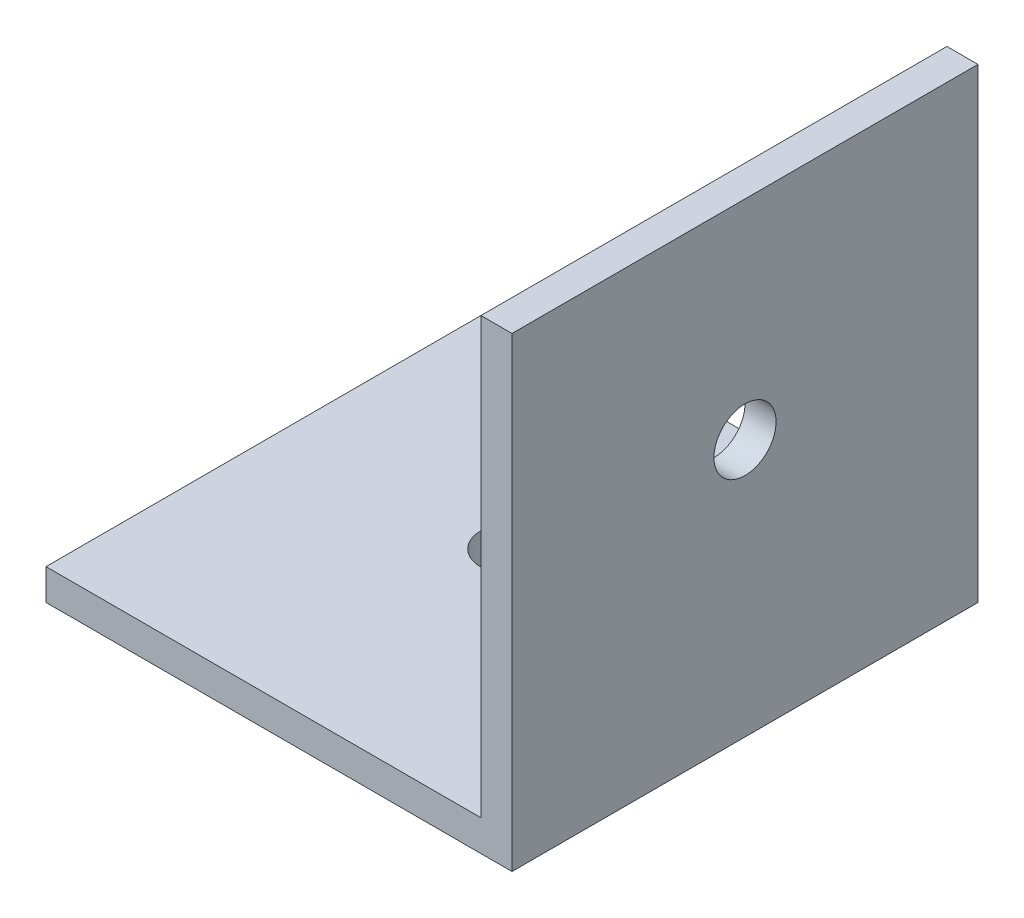
ISO-10303-21;
HEADER;
FILE_DESCRIPTION(('STEP AP214'),'2;1');
FILE_NAME('part.step','',(''),(''),'','','');
FILE_SCHEMA(('AUTOMOTIVE_DESIGN { 1 0 10303 214 1 1 1 1 }'));
ENDSEC;
DATA;
#1=APPLICATION_CONTEXT('core data for automotive mechanical design processes');
#2=APPLICATION_PROTOCOL_DEFINITION('international standard','automotive_design',2000,#1);
#3=PRODUCT_CONTEXT('',#1,'mechanical');
#4=PRODUCT('Part','Part','',(#3));
#5=PRODUCT_RELATED_PRODUCT_CATEGORY('part','',(#4));
#6=PRODUCT_DEFINITION_FORMATION('','',#4);
#7=PRODUCT_DEFINITION_CONTEXT('part definition',#1,'design');
#8=PRODUCT_DEFINITION('design','',#6,#7);
#9=PRODUCT_DEFINITION_SHAPE('','',#8);
#10=(LENGTH_UNIT() NAMED_UNIT(*) SI_UNIT(.MILLI.,.METRE.));
#11=(NAMED_UNIT(*) PLANE_ANGLE_UNIT() SI_UNIT($,.RADIAN.));
#12=(NAMED_UNIT(*) SI_UNIT($,.STERADIAN.) SOLID_ANGLE_UNIT());
#13=UNCERTAINTY_MEASURE_WITH_UNIT(LENGTH_MEASURE(1.E-05),#10,'distance_accuracy_value','');
#14=(GEOMETRIC_REPRESENTATION_CONTEXT(3) GLOBAL_UNCERTAINTY_ASSIGNED_CONTEXT((#13)) GLOBAL_UNIT_ASSIGNED_CONTEXT((#10,
#11,#12)) REPRESENTATION_CONTEXT('',''));
#15=CARTESIAN_POINT('',(0.,0.,0.));
#16=DIRECTION('',(0.,0.,1.));
#17=DIRECTION('',(1.,0.,0.));
#18=AXIS2_PLACEMENT_3D('',#15,#16,#17);
#19=CARTESIAN_POINT('',(0.,15.,15.));
#20=DIRECTION('',(-1.,0.,0.));
#21=DIRECTION('',(0.,-1.,0.));
#22=AXIS2_PLACEMENT_3D('',#19,#20,#21);
#23=PLANE('',#22);
#24=CARTESIAN_POINT('',(0.,8.28833267638939,7.5));
#25=DIRECTION('',(-1.,0.,0.));
#26=DIRECTION('',(0.,-1.,0.));
#27=AXIS2_PLACEMENT_3D('',#24,#25,#26);
#28=CIRCLE('',#27,1.);
#29=CARTESIAN_POINT('',(0.,7.28833267638939,7.5));
#30=VERTEX_POINT('',#29);
#31=EDGE_CURVE('E127',#30,#30,#28,.T.);
#32=ORIENTED_EDGE('',*,*,#31,.T.);
#33=EDGE_LOOP('',(#32));
#34=FACE_BOUND('',#33,.T.);
#35=DIRECTION('',(0.,1.,0.));
#36=VECTOR('',#35,1.);
#37=CARTESIAN_POINT('',(0.,15.,0.));
#38=LINE('',#37,#36);
#39=CARTESIAN_POINT('',(0.,0.,0.));
#40=VERTEX_POINT('',#39);
#41=CARTESIAN_POINT('',(0.,15.,0.));
#42=VERTEX_POINT('',#41);
#43=EDGE_CURVE('E123',#40,#42,#38,.T.);
#44=ORIENTED_EDGE('',*,*,#43,.T.);
#45=DIRECTION('',(0.,0.,-1.));
#46=VECTOR('',#45,1.);
#47=CARTESIAN_POINT('',(0.,15.,15.));
#48=LINE('',#47,#46);
#49=CARTESIAN_POINT('',(0.,15.,15.));
#50=VERTEX_POINT('',#49);
#51=EDGE_CURVE('E11',#50,#42,#48,.T.);
#52=ORIENTED_EDGE('',*,*,#51,.F.);
#53=DIRECTION('',(0.,1.,0.));
#54=VECTOR('',#53,1.);
#55=CARTESIAN_POINT('',(0.,15.,15.));
#56=LINE('',#55,#54);
#57=CARTESIAN_POINT('',(0.,0.,15.));
#58=VERTEX_POINT('',#57);
#59=EDGE_CURVE('E134',#58,#50,#56,.T.);
#60=ORIENTED_EDGE('',*,*,#59,.F.);
#61=DIRECTION('',(0.,0.,-1.));
#62=VECTOR('',#61,1.);
#63=CARTESIAN_POINT('',(0.,0.,15.));
#64=LINE('',#63,#62);
#65=EDGE_CURVE('E119',#58,#40,#64,.T.);
#66=ORIENTED_EDGE('',*,*,#65,.T.);
#67=EDGE_LOOP('',(#44,#52,#60,#66));
#68=FACE_BOUND('',#67,.T.);
#69=ADVANCED_FACE('F39',(#34,#68),#23,.F.);
#70=CARTESIAN_POINT('',(-1.,15.,15.));
#71=DIRECTION('',(0.,-1.,0.));
#72=DIRECTION('',(0.,0.,-1.));
#73=AXIS2_PLACEMENT_3D('',#70,#71,#72);
#74=PLANE('',#73);
#75=DIRECTION('',(-1.,0.,0.));
#76=VECTOR('',#75,1.);
#77=CARTESIAN_POINT('',(-1.,15.,0.));
#78=LINE('',#77,#76);
#79=CARTESIAN_POINT('',(-1.,15.,0.));
#80=VERTEX_POINT('',#79);
#81=EDGE_CURVE('E126',#42,#80,#78,.T.);
#82=ORIENTED_EDGE('',*,*,#81,.T.);
#83=DIRECTION('',(0.,0.,-1.));
#84=VECTOR('',#83,1.);
#85=CARTESIAN_POINT('',(-1.,15.,15.));
#86=LINE('',#85,#84);
#87=CARTESIAN_POINT('',(-1.,15.,15.));
#88=VERTEX_POINT('',#87);
#89=EDGE_CURVE('E47',#88,#80,#86,.T.);
#90=ORIENTED_EDGE('',*,*,#89,.F.);
#91=DIRECTION('',(-1.,0.,0.));
#92=VECTOR('',#91,1.);
#93=CARTESIAN_POINT('',(-1.,15.,15.));
#94=LINE('',#93,#92);
#95=EDGE_CURVE('E92',#50,#88,#94,.T.);
#96=ORIENTED_EDGE('',*,*,#95,.F.);
#97=ORIENTED_EDGE('',*,*,#51,.T.);
#98=EDGE_LOOP('',(#82,#90,#96,#97));
#99=FACE_BOUND('',#98,.T.);
#100=ADVANCED_FACE('F160',(#99),#74,.F.);
#101=CARTESIAN_POINT('',(-1.,0.999999999999998,15.));
#102=DIRECTION('',(1.,0.,0.));
#103=DIRECTION('',(0.,1.,0.));
#104=AXIS2_PLACEMENT_3D('',#101,#102,#103);
#105=PLANE('',#104);
#106=CARTESIAN_POINT('',(-1.,8.28833267638939,7.5));
#107=DIRECTION('',(-1.,0.,0.));
#108=DIRECTION('',(0.,-1.,0.));
#109=AXIS2_PLACEMENT_3D('',#106,#107,#108);
#110=CIRCLE('',#109,1.);
#111=CARTESIAN_POINT('',(-1.,7.28833267638939,7.5));
#112=VERTEX_POINT('',#111);
#113=EDGE_CURVE('E168',#112,#112,#110,.T.);
#114=ORIENTED_EDGE('',*,*,#113,.F.);
#115=EDGE_LOOP('',(#114));
#116=FACE_BOUND('',#115,.T.);
#117=DIRECTION('',(0.,-1.,0.));
#118=VECTOR('',#117,1.);
#119=CARTESIAN_POINT('',(-1.,0.999999999999998,0.));
#120=LINE('',#119,#118);
#121=CARTESIAN_POINT('',(-1.,0.999999999999998,0.));
#122=VERTEX_POINT('',#121);
#123=EDGE_CURVE('E129',#80,#122,#120,.T.);
#124=ORIENTED_EDGE('',*,*,#123,.T.);
#125=DIRECTION('',(0.,0.,-1.));
#126=VECTOR('',#125,1.);
#127=CARTESIAN_POINT('',(-1.,0.999999999999998,15.));
#128=LINE('',#127,#126);
#129=CARTESIAN_POINT('',(-1.,0.999999999999998,15.));
#130=VERTEX_POINT('',#129);
#131=EDGE_CURVE('E114',#130,#122,#128,.T.);
#132=ORIENTED_EDGE('',*,*,#131,.F.);
#133=DIRECTION('',(0.,-1.,0.));
#134=VECTOR('',#133,1.);
#135=CARTESIAN_POINT('',(-1.,0.999999999999998,15.));
#136=LINE('',#135,#134);
#137=EDGE_CURVE('E105',#88,#130,#136,.T.);
#138=ORIENTED_EDGE('',*,*,#137,.F.);
#139=ORIENTED_EDGE('',*,*,#89,.T.);
#140=EDGE_LOOP('',(#124,#132,#138,#139));
#141=FACE_BOUND('',#140,.T.);
#142=ADVANCED_FACE('F140',(#116,#141),#105,.F.);
#143=CARTESIAN_POINT('',(-15.,0.999999999999998,15.));
#144=DIRECTION('',(0.,-1.,0.));
#145=DIRECTION('',(0.,0.,-1.));
#146=AXIS2_PLACEMENT_3D('',#143,#144,#145);
#147=PLANE('',#146);
#148=CARTESIAN_POINT('',(-8.,0.999999999999998,7.01198453366372));
#149=DIRECTION('',(0.,1.,0.));
#150=DIRECTION('',(0.,0.,1.));
#151=AXIS2_PLACEMENT_3D('',#148,#149,#150);
#152=CIRCLE('',#151,1.);
#153=CARTESIAN_POINT('',(-8.,0.999999999999998,8.01198453366372));
#154=VERTEX_POINT('',#153);
#155=EDGE_CURVE('E174',#154,#154,#152,.T.);
#156=ORIENTED_EDGE('',*,*,#155,.F.);
#157=EDGE_LOOP('',(#156));
#158=FACE_BOUND('',#157,.T.);
#159=DIRECTION('',(-1.,0.,0.));
#160=VECTOR('',#159,1.);
#161=CARTESIAN_POINT('',(-15.,0.999999999999998,0.));
#162=LINE('',#161,#160);
#163=CARTESIAN_POINT('',(-15.,0.999999999999998,0.));
#164=VERTEX_POINT('',#163);
#165=EDGE_CURVE('E113',#122,#164,#162,.T.);
#166=ORIENTED_EDGE('',*,*,#165,.T.);
#167=DIRECTION('',(0.,0.,-1.));
#168=VECTOR('',#167,1.);
#169=CARTESIAN_POINT('',(-15.,0.999999999999998,15.));
#170=LINE('',#169,#168);
#171=CARTESIAN_POINT('',(-15.,0.999999999999998,15.));
#172=VERTEX_POINT('',#171);
#173=EDGE_CURVE('E110',#172,#164,#170,.T.);
#174=ORIENTED_EDGE('',*,*,#173,.F.);
#175=DIRECTION('',(-1.,0.,0.));
#176=VECTOR('',#175,1.);
#177=CARTESIAN_POINT('',(-15.,0.999999999999998,15.));
#178=LINE('',#177,#176);
#179=EDGE_CURVE('E99',#130,#172,#178,.T.);
#180=ORIENTED_EDGE('',*,*,#179,.F.);
#181=ORIENTED_EDGE('',*,*,#131,.T.);
#182=EDGE_LOOP('',(#166,#174,#180,#181));
#183=FACE_BOUND('',#182,.T.);
#184=ADVANCED_FACE('F111',(#158,#183),#147,.F.);
#185=CARTESIAN_POINT('',(-15.,0.,15.));
#186=DIRECTION('',(1.,0.,0.));
#187=DIRECTION('',(0.,0.,-1.));
#188=AXIS2_PLACEMENT_3D('',#185,#186,#187);
#189=PLANE('',#188);
#190=DIRECTION('',(0.,-1.,0.));
#191=VECTOR('',#190,1.);
#192=CARTESIAN_POINT('',(-15.,0.,0.));
#193=LINE('',#192,#191);
#194=CARTESIAN_POINT('',(-15.,0.,0.));
#195=VERTEX_POINT('',#194);
#196=EDGE_CURVE('E78',#164,#195,#193,.T.);
#197=ORIENTED_EDGE('',*,*,#196,.T.);
#198=DIRECTION('',(0.,0.,-1.));
#199=VECTOR('',#198,1.);
#200=CARTESIAN_POINT('',(-15.,0.,15.));
#201=LINE('',#200,#199);
#202=CARTESIAN_POINT('',(-15.,0.,15.));
#203=VERTEX_POINT('',#202);
#204=EDGE_CURVE('E115',#203,#195,#201,.T.);
#205=ORIENTED_EDGE('',*,*,#204,.F.);
#206=DIRECTION('',(0.,-1.,0.));
#207=VECTOR('',#206,1.);
#208=CARTESIAN_POINT('',(-15.,0.,15.));
#209=LINE('',#208,#207);
#210=EDGE_CURVE('E103',#172,#203,#209,.T.);
#211=ORIENTED_EDGE('',*,*,#210,.F.);
#212=ORIENTED_EDGE('',*,*,#173,.T.);
#213=EDGE_LOOP('',(#197,#205,#211,#212));
#214=FACE_BOUND('',#213,.T.);
#215=ADVANCED_FACE('F117',(#214),#189,.F.);
#216=CARTESIAN_POINT('',(0.,0.,15.));
#217=DIRECTION('',(0.,1.,0.));
#218=DIRECTION('',(-1.,0.,0.));
#219=AXIS2_PLACEMENT_3D('',#216,#217,#218);
#220=PLANE('',#219);
#221=CARTESIAN_POINT('',(-8.,0.,7.01198453366372));
#222=DIRECTION('',(0.,1.,0.));
#223=DIRECTION('',(0.,0.,1.));
#224=AXIS2_PLACEMENT_3D('',#221,#222,#223);
#225=CIRCLE('',#224,1.);
#226=CARTESIAN_POINT('',(-8.,0.,8.01198453366372));
#227=VERTEX_POINT('',#226);
#228=EDGE_CURVE('E171',#227,#227,#225,.T.);
#229=ORIENTED_EDGE('',*,*,#228,.T.);
#230=EDGE_LOOP('',(#229));
#231=FACE_BOUND('',#230,.T.);
#232=DIRECTION('',(1.,0.,0.));
#233=VECTOR('',#232,1.);
#234=CARTESIAN_POINT('',(0.,0.,0.));
#235=LINE('',#234,#233);
#236=EDGE_CURVE('E84',#195,#40,#235,.T.);
#237=ORIENTED_EDGE('',*,*,#236,.T.);
#238=ORIENTED_EDGE('',*,*,#65,.F.);
#239=DIRECTION('',(1.,0.,0.));
#240=VECTOR('',#239,1.);
#241=CARTESIAN_POINT('',(0.,0.,15.));
#242=LINE('',#241,#240);
#243=EDGE_CURVE('E55',#203,#58,#242,.T.);
#244=ORIENTED_EDGE('',*,*,#243,.F.);
#245=ORIENTED_EDGE('',*,*,#204,.T.);
#246=EDGE_LOOP('',(#237,#238,#244,#245));
#247=FACE_BOUND('',#246,.T.);
#248=ADVANCED_FACE('F147',(#231,#247),#220,.F.);
#249=CARTESIAN_POINT('',(0.,0.,15.));
#250=DIRECTION('',(0.,0.,-1.));
#251=DIRECTION('',(-1.,0.,0.));
#252=AXIS2_PLACEMENT_3D('',#249,#250,#251);
#253=PLANE('',#252);
#254=ORIENTED_EDGE('',*,*,#59,.T.);
#255=ORIENTED_EDGE('',*,*,#95,.T.);
#256=ORIENTED_EDGE('',*,*,#137,.T.);
#257=ORIENTED_EDGE('',*,*,#179,.T.);
#258=ORIENTED_EDGE('',*,*,#210,.T.);
#259=ORIENTED_EDGE('',*,*,#243,.T.);
#260=EDGE_LOOP('',(#254,#255,#256,#257,#258,#259));
#261=FACE_BOUND('',#260,.T.);
#262=ADVANCED_FACE('F101',(#261),#253,.F.);
#263=CARTESIAN_POINT('',(0.,0.,0.));
#264=DIRECTION('',(0.,0.,-1.));
#265=DIRECTION('',(-1.,0.,0.));
#266=AXIS2_PLACEMENT_3D('',#263,#264,#265);
#267=PLANE('',#266);
#268=ORIENTED_EDGE('',*,*,#43,.F.);
#269=ORIENTED_EDGE('',*,*,#236,.F.);
#270=ORIENTED_EDGE('',*,*,#196,.F.);
#271=ORIENTED_EDGE('',*,*,#165,.F.);
#272=ORIENTED_EDGE('',*,*,#123,.F.);
#273=ORIENTED_EDGE('',*,*,#81,.F.);
#274=EDGE_LOOP('',(#268,#269,#270,#271,#272,#273));
#275=FACE_BOUND('',#274,.T.);
#276=ADVANCED_FACE('F143',(#275),#267,.T.);
#277=CARTESIAN_POINT('',(0.,8.28833267638939,7.5));
#278=DIRECTION('',(-1.,0.,0.));
#279=DIRECTION('',(0.,-1.,0.));
#280=AXIS2_PLACEMENT_3D('',#277,#278,#279);
#281=CYLINDRICAL_SURFACE('',#280,1.);
#282=ORIENTED_EDGE('',*,*,#31,.F.);
#283=EDGE_LOOP('',(#282));
#284=FACE_BOUND('',#283,.T.);
#285=ORIENTED_EDGE('',*,*,#113,.T.);
#286=EDGE_LOOP('',(#285));
#287=FACE_BOUND('',#286,.T.);
#288=ADVANCED_FACE('F184',(#284,#287),#281,.F.);
#289=CARTESIAN_POINT('',(-8.,0.,7.01198453366372));
#290=DIRECTION('',(0.,1.,0.));
#291=DIRECTION('',(0.,0.,1.));
#292=AXIS2_PLACEMENT_3D('',#289,#290,#291);
#293=CYLINDRICAL_SURFACE('',#292,1.);
#294=ORIENTED_EDGE('',*,*,#228,.F.);
#295=EDGE_LOOP('',(#294));
#296=FACE_BOUND('',#295,.T.);
#297=ORIENTED_EDGE('',*,*,#155,.T.);
#298=EDGE_LOOP('',(#297));
#299=FACE_BOUND('',#298,.T.);
#300=ADVANCED_FACE('F181',(#296,#299),#293,.F.);
#301=CLOSED_SHELL('',(#69,#100,#142,#184,#215,#248,#262,#276,#288,#300));
#302=MANIFOLD_SOLID_BREP('B2',#301);
#303=ADVANCED_BREP_SHAPE_REPRESENTATION('',(#18,#302),#14);
#304=SHAPE_DEFINITION_REPRESENTATION(#9,#303);
ENDSEC;
END-ISO-10303-21;
